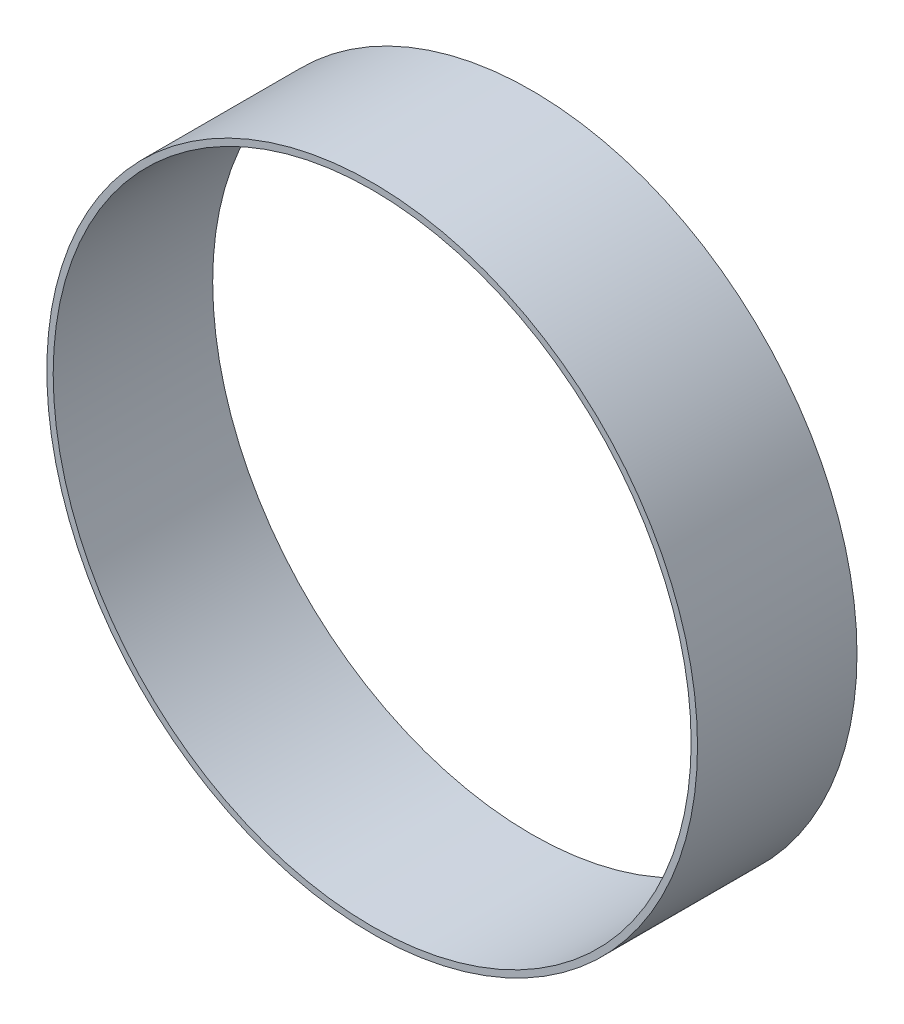
ISO-10303-21;
HEADER;
FILE_DESCRIPTION(('STEP AP214'),'2;1');
FILE_NAME('part.step','',(''),(''),'','','');
FILE_SCHEMA(('AUTOMOTIVE_DESIGN { 1 0 10303 214 1 1 1 1 }'));
ENDSEC;
DATA;
#1=APPLICATION_CONTEXT('core data for automotive mechanical design processes');
#2=APPLICATION_PROTOCOL_DEFINITION('international standard','automotive_design',2000,#1);
#3=PRODUCT_CONTEXT('',#1,'mechanical');
#4=PRODUCT('Part','Part','',(#3));
#5=PRODUCT_RELATED_PRODUCT_CATEGORY('part','',(#4));
#6=PRODUCT_DEFINITION_FORMATION('','',#4);
#7=PRODUCT_DEFINITION_CONTEXT('part definition',#1,'design');
#8=PRODUCT_DEFINITION('design','',#6,#7);
#9=PRODUCT_DEFINITION_SHAPE('','',#8);
#10=(LENGTH_UNIT() NAMED_UNIT(*) SI_UNIT(.MILLI.,.METRE.));
#11=(NAMED_UNIT(*) PLANE_ANGLE_UNIT() SI_UNIT($,.RADIAN.));
#12=(NAMED_UNIT(*) SI_UNIT($,.STERADIAN.) SOLID_ANGLE_UNIT());
#13=UNCERTAINTY_MEASURE_WITH_UNIT(LENGTH_MEASURE(1.E-05),#10,'distance_accuracy_value','');
#14=(GEOMETRIC_REPRESENTATION_CONTEXT(3) GLOBAL_UNCERTAINTY_ASSIGNED_CONTEXT((#13)) GLOBAL_UNIT_ASSIGNED_CONTEXT((#10,
#11,#12)) REPRESENTATION_CONTEXT('',''));
#15=CARTESIAN_POINT('',(0.,0.,0.));
#16=DIRECTION('',(0.,0.,1.));
#17=DIRECTION('',(1.,0.,0.));
#18=AXIS2_PLACEMENT_3D('',#15,#16,#17);
#19=CARTESIAN_POINT('',(0.,0.,25.));
#20=DIRECTION('',(0.,0.,1.));
#21=DIRECTION('',(1.,0.,0.));
#22=AXIS2_PLACEMENT_3D('',#19,#20,#21);
#23=PLANE('',#22);
#24=CARTESIAN_POINT('',(0.,0.,25.));
#25=DIRECTION('',(0.,0.,1.));
#26=DIRECTION('',(1.,0.,0.));
#27=AXIS2_PLACEMENT_3D('',#24,#25,#26);
#28=CIRCLE('',#27,51.);
#29=CARTESIAN_POINT('',(51.,0.,25.));
#30=VERTEX_POINT('',#29);
#31=EDGE_CURVE('E10',#30,#30,#28,.T.);
#32=ORIENTED_EDGE('',*,*,#31,.T.);
#33=EDGE_LOOP('',(#32));
#34=FACE_BOUND('',#33,.T.);
#35=CARTESIAN_POINT('',(0.,0.,25.));
#36=DIRECTION('',(0.,0.,1.));
#37=DIRECTION('',(1.,0.,0.));
#38=AXIS2_PLACEMENT_3D('',#35,#36,#37);
#39=CIRCLE('',#38,50.);
#40=CARTESIAN_POINT('',(50.,0.,25.));
#41=VERTEX_POINT('',#40);
#42=EDGE_CURVE('E43',#41,#41,#39,.T.);
#43=ORIENTED_EDGE('',*,*,#42,.F.);
#44=EDGE_LOOP('',(#43));
#45=FACE_BOUND('',#44,.T.);
#46=ADVANCED_FACE('F32',(#34,#45),#23,.T.);
#47=CARTESIAN_POINT('',(0.,0.,0.));
#48=DIRECTION('',(0.,0.,1.));
#49=DIRECTION('',(1.,0.,0.));
#50=AXIS2_PLACEMENT_3D('',#47,#48,#49);
#51=PLANE('',#50);
#52=CARTESIAN_POINT('',(0.,0.,0.));
#53=DIRECTION('',(0.,0.,1.));
#54=DIRECTION('',(1.,0.,0.));
#55=AXIS2_PLACEMENT_3D('',#52,#53,#54);
#56=CIRCLE('',#55,51.);
#57=CARTESIAN_POINT('',(51.,0.,0.));
#58=VERTEX_POINT('',#57);
#59=EDGE_CURVE('E36',#58,#58,#56,.T.);
#60=ORIENTED_EDGE('',*,*,#59,.F.);
#61=EDGE_LOOP('',(#60));
#62=FACE_BOUND('',#61,.T.);
#63=CARTESIAN_POINT('',(0.,0.,0.));
#64=DIRECTION('',(0.,0.,1.));
#65=DIRECTION('',(1.,0.,0.));
#66=AXIS2_PLACEMENT_3D('',#63,#64,#65);
#67=CIRCLE('',#66,50.);
#68=CARTESIAN_POINT('',(50.,0.,0.));
#69=VERTEX_POINT('',#68);
#70=EDGE_CURVE('E45',#69,#69,#67,.T.);
#71=ORIENTED_EDGE('',*,*,#70,.T.);
#72=EDGE_LOOP('',(#71));
#73=FACE_BOUND('',#72,.T.);
#74=ADVANCED_FACE('F55',(#62,#73),#51,.F.);
#75=CARTESIAN_POINT('',(0.,0.,25.));
#76=DIRECTION('',(0.,0.,-1.));
#77=DIRECTION('',(-1.,0.,0.));
#78=AXIS2_PLACEMENT_3D('',#75,#76,#77);
#79=CYLINDRICAL_SURFACE('',#78,51.);
#80=ORIENTED_EDGE('',*,*,#31,.F.);
#81=EDGE_LOOP('',(#80));
#82=FACE_BOUND('',#81,.T.);
#83=ORIENTED_EDGE('',*,*,#59,.T.);
#84=EDGE_LOOP('',(#83));
#85=FACE_BOUND('',#84,.T.);
#86=ADVANCED_FACE('F34',(#82,#85),#79,.T.);
#87=CARTESIAN_POINT('',(0.,0.,25.));
#88=DIRECTION('',(0.,0.,-1.));
#89=DIRECTION('',(-1.,0.,0.));
#90=AXIS2_PLACEMENT_3D('',#87,#88,#89);
#91=CYLINDRICAL_SURFACE('',#90,50.);
#92=ORIENTED_EDGE('',*,*,#42,.T.);
#93=EDGE_LOOP('',(#92));
#94=FACE_BOUND('',#93,.T.);
#95=ORIENTED_EDGE('',*,*,#70,.F.);
#96=EDGE_LOOP('',(#95));
#97=FACE_BOUND('',#96,.T.);
#98=ADVANCED_FACE('F51',(#94,#97),#91,.F.);
#99=CLOSED_SHELL('',(#46,#74,#86,#98));
#100=MANIFOLD_SOLID_BREP('B2',#99);
#101=ADVANCED_BREP_SHAPE_REPRESENTATION('',(#18,#100),#14);
#102=SHAPE_DEFINITION_REPRESENTATION(#9,#101);
ENDSEC;
END-ISO-10303-21;
